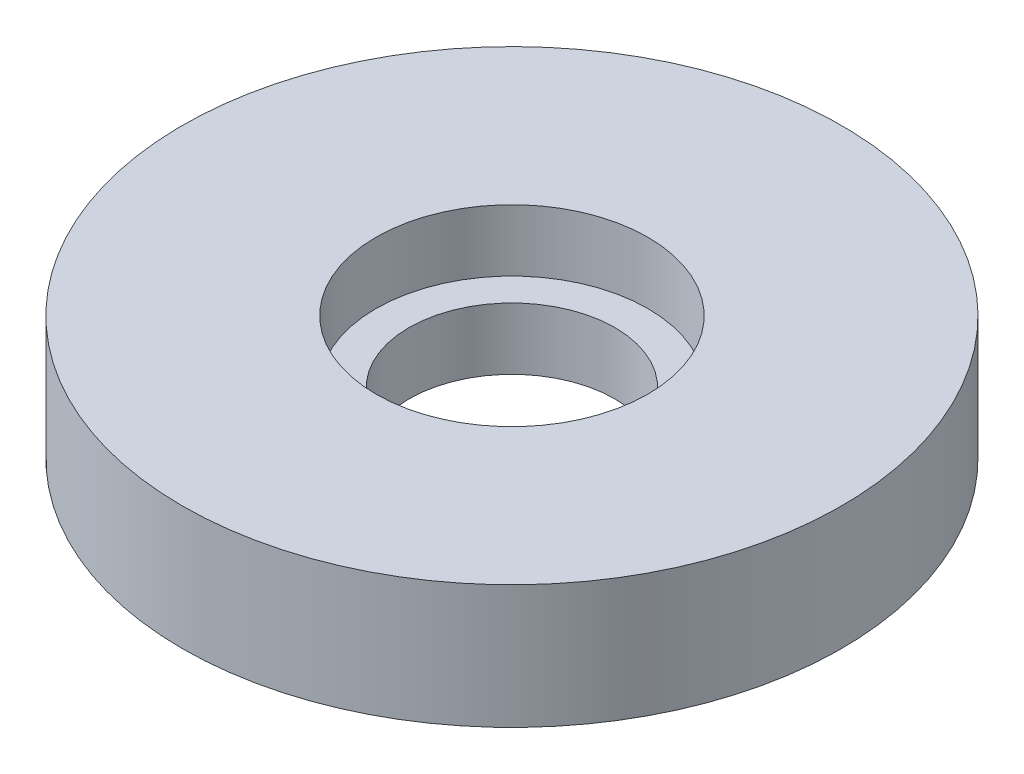
ISO-10303-21;
HEADER;
FILE_DESCRIPTION(('STEP AP214'),'2;1');
FILE_NAME('part.step','',(''),(''),'','','');
FILE_SCHEMA(('AUTOMOTIVE_DESIGN { 1 0 10303 214 1 1 1 1 }'));
ENDSEC;
DATA;
#1=APPLICATION_CONTEXT('core data for automotive mechanical design processes');
#2=APPLICATION_PROTOCOL_DEFINITION('international standard','automotive_design',2000,#1);
#3=PRODUCT_CONTEXT('',#1,'mechanical');
#4=PRODUCT('Part','Part','',(#3));
#5=PRODUCT_RELATED_PRODUCT_CATEGORY('part','',(#4));
#6=PRODUCT_DEFINITION_FORMATION('','',#4);
#7=PRODUCT_DEFINITION_CONTEXT('part definition',#1,'design');
#8=PRODUCT_DEFINITION('design','',#6,#7);
#9=PRODUCT_DEFINITION_SHAPE('','',#8);
#10=(LENGTH_UNIT() NAMED_UNIT(*) SI_UNIT(.MILLI.,.METRE.));
#11=(NAMED_UNIT(*) PLANE_ANGLE_UNIT() SI_UNIT($,.RADIAN.));
#12=(NAMED_UNIT(*) SI_UNIT($,.STERADIAN.) SOLID_ANGLE_UNIT());
#13=UNCERTAINTY_MEASURE_WITH_UNIT(LENGTH_MEASURE(1.E-05),#10,'distance_accuracy_value','');
#14=(GEOMETRIC_REPRESENTATION_CONTEXT(3) GLOBAL_UNCERTAINTY_ASSIGNED_CONTEXT((#13)) GLOBAL_UNIT_ASSIGNED_CONTEXT((#10,
#11,#12)) REPRESENTATION_CONTEXT('',''));
#15=CARTESIAN_POINT('',(0.,0.,0.));
#16=DIRECTION('',(0.,0.,1.));
#17=DIRECTION('',(1.,0.,0.));
#18=AXIS2_PLACEMENT_3D('',#15,#16,#17);
#19=CARTESIAN_POINT('',(0.,6.,0.));
#20=DIRECTION('',(0.,-1.,0.));
#21=DIRECTION('',(0.,0.,-1.));
#22=AXIS2_PLACEMENT_3D('',#19,#20,#21);
#23=CYLINDRICAL_SURFACE('',#22,16.);
#24=CARTESIAN_POINT('',(0.,6.,0.));
#25=DIRECTION('',(0.,1.,0.));
#26=DIRECTION('',(0.,0.,1.));
#27=AXIS2_PLACEMENT_3D('',#24,#25,#26);
#28=CIRCLE('',#27,16.);
#29=CARTESIAN_POINT('',(0.,6.,16.));
#30=VERTEX_POINT('',#29);
#31=EDGE_CURVE('E10',#30,#30,#28,.T.);
#32=ORIENTED_EDGE('',*,*,#31,.F.);
#33=EDGE_LOOP('',(#32));
#34=FACE_BOUND('',#33,.T.);
#35=CARTESIAN_POINT('',(0.,0.,0.));
#36=DIRECTION('',(0.,1.,0.));
#37=DIRECTION('',(0.,0.,1.));
#38=AXIS2_PLACEMENT_3D('',#35,#36,#37);
#39=CIRCLE('',#38,16.);
#40=CARTESIAN_POINT('',(0.,0.,16.));
#41=VERTEX_POINT('',#40);
#42=EDGE_CURVE('E38',#41,#41,#39,.T.);
#43=ORIENTED_EDGE('',*,*,#42,.T.);
#44=EDGE_LOOP('',(#43));
#45=FACE_BOUND('',#44,.T.);
#46=ADVANCED_FACE('F35',(#34,#45),#23,.T.);
#47=CARTESIAN_POINT('',(0.,6.,0.));
#48=DIRECTION('',(0.,1.,0.));
#49=DIRECTION('',(0.,0.,1.));
#50=AXIS2_PLACEMENT_3D('',#47,#48,#49);
#51=PLANE('',#50);
#52=CARTESIAN_POINT('',(0.,6.,0.));
#53=DIRECTION('',(0.,1.,0.));
#54=DIRECTION('',(0.,0.,1.));
#55=AXIS2_PLACEMENT_3D('',#52,#53,#54);
#56=CIRCLE('',#55,6.6);
#57=CARTESIAN_POINT('',(0.,6.,6.6));
#58=VERTEX_POINT('',#57);
#59=EDGE_CURVE('E49',#58,#58,#56,.T.);
#60=ORIENTED_EDGE('',*,*,#59,.F.);
#61=EDGE_LOOP('',(#60));
#62=FACE_BOUND('',#61,.T.);
#63=ORIENTED_EDGE('',*,*,#31,.T.);
#64=EDGE_LOOP('',(#63));
#65=FACE_BOUND('',#64,.T.);
#66=ADVANCED_FACE('F78',(#62,#65),#51,.T.);
#67=CARTESIAN_POINT('',(0.,0.,0.));
#68=DIRECTION('',(0.,1.,0.));
#69=DIRECTION('',(0.,0.,1.));
#70=AXIS2_PLACEMENT_3D('',#67,#68,#69);
#71=PLANE('',#70);
#72=CARTESIAN_POINT('',(0.,0.,0.));
#73=DIRECTION('',(0.,-1.,0.));
#74=DIRECTION('',(0.,0.,-1.));
#75=AXIS2_PLACEMENT_3D('',#72,#73,#74);
#76=CIRCLE('',#75,5.);
#77=CARTESIAN_POINT('',(0.,0.,-5.));
#78=VERTEX_POINT('',#77);
#79=EDGE_CURVE('E57',#78,#78,#76,.T.);
#80=ORIENTED_EDGE('',*,*,#79,.F.);
#81=EDGE_LOOP('',(#80));
#82=FACE_BOUND('',#81,.T.);
#83=ORIENTED_EDGE('',*,*,#42,.F.);
#84=EDGE_LOOP('',(#83));
#85=FACE_BOUND('',#84,.T.);
#86=ADVANCED_FACE('F74',(#82,#85),#71,.F.);
#87=CARTESIAN_POINT('',(0.,3.,0.));
#88=DIRECTION('',(0.,1.,0.));
#89=DIRECTION('',(0.,0.,1.));
#90=AXIS2_PLACEMENT_3D('',#87,#88,#89);
#91=CYLINDRICAL_SURFACE('',#90,6.6);
#92=CARTESIAN_POINT('',(0.,3.,0.));
#93=DIRECTION('',(0.,1.,0.));
#94=DIRECTION('',(0.,0.,1.));
#95=AXIS2_PLACEMENT_3D('',#92,#93,#94);
#96=CIRCLE('',#95,6.6);
#97=CARTESIAN_POINT('',(0.,3.,6.6));
#98=VERTEX_POINT('',#97);
#99=EDGE_CURVE('E47',#98,#98,#96,.T.);
#100=ORIENTED_EDGE('',*,*,#99,.F.);
#101=EDGE_LOOP('',(#100));
#102=FACE_BOUND('',#101,.T.);
#103=ORIENTED_EDGE('',*,*,#59,.T.);
#104=EDGE_LOOP('',(#103));
#105=FACE_BOUND('',#104,.T.);
#106=ADVANCED_FACE('F77',(#102,#105),#91,.F.);
#107=CARTESIAN_POINT('',(0.,3.,0.));
#108=DIRECTION('',(0.,1.,0.));
#109=DIRECTION('',(0.,0.,1.));
#110=AXIS2_PLACEMENT_3D('',#107,#108,#109);
#111=PLANE('',#110);
#112=CARTESIAN_POINT('',(0.,3.,0.));
#113=DIRECTION('',(0.,-1.,0.));
#114=DIRECTION('',(0.,0.,-1.));
#115=AXIS2_PLACEMENT_3D('',#112,#113,#114);
#116=CIRCLE('',#115,5.);
#117=CARTESIAN_POINT('',(0.,3.,-5.));
#118=VERTEX_POINT('',#117);
#119=EDGE_CURVE('E53',#118,#118,#116,.T.);
#120=ORIENTED_EDGE('',*,*,#119,.T.);
#121=EDGE_LOOP('',(#120));
#122=FACE_BOUND('',#121,.T.);
#123=ORIENTED_EDGE('',*,*,#99,.T.);
#124=EDGE_LOOP('',(#123));
#125=FACE_BOUND('',#124,.T.);
#126=ADVANCED_FACE('F65',(#122,#125),#111,.T.);
#127=CARTESIAN_POINT('',(0.,3.,0.));
#128=DIRECTION('',(0.,-1.,0.));
#129=DIRECTION('',(0.,0.,-1.));
#130=AXIS2_PLACEMENT_3D('',#127,#128,#129);
#131=CYLINDRICAL_SURFACE('',#130,5.);
#132=ORIENTED_EDGE('',*,*,#119,.F.);
#133=EDGE_LOOP('',(#132));
#134=FACE_BOUND('',#133,.T.);
#135=ORIENTED_EDGE('',*,*,#79,.T.);
#136=EDGE_LOOP('',(#135));
#137=FACE_BOUND('',#136,.T.);
#138=ADVANCED_FACE('F68',(#134,#137),#131,.F.);
#139=CLOSED_SHELL('',(#46,#66,#86,#106,#126,#138));
#140=MANIFOLD_SOLID_BREP('B2',#139);
#141=ADVANCED_BREP_SHAPE_REPRESENTATION('',(#18,#140),#14);
#142=SHAPE_DEFINITION_REPRESENTATION(#9,#141);
ENDSEC;
END-ISO-10303-21;
